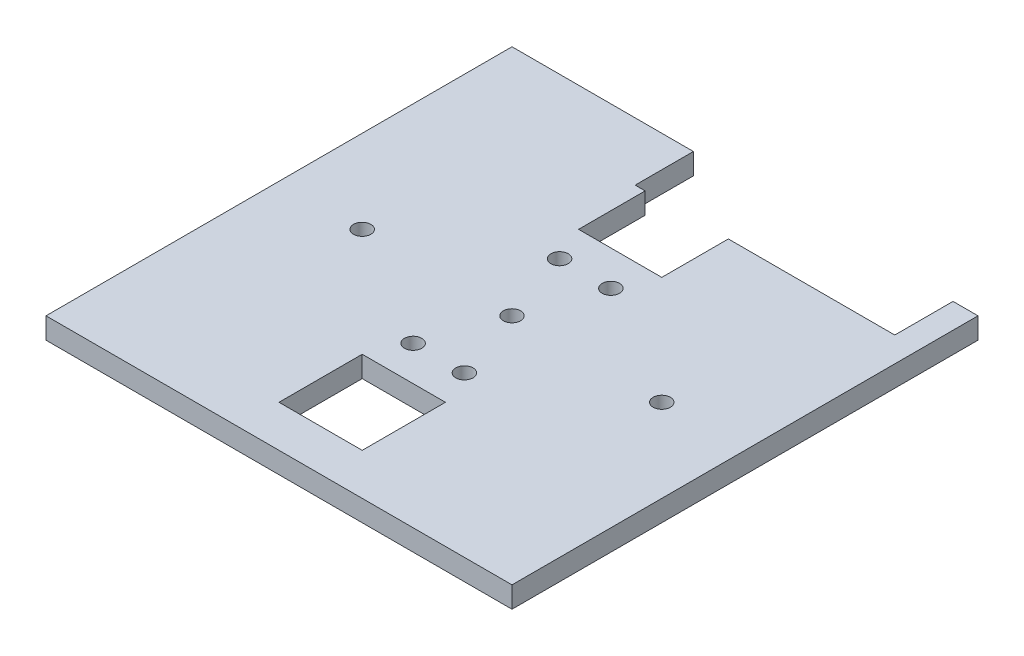
ISO-10303-21;
HEADER;
FILE_DESCRIPTION(('STEP AP214'),'2;1');
FILE_NAME('part.step','',(''),(''),'','','');
FILE_SCHEMA(('AUTOMOTIVE_DESIGN { 1 0 10303 214 1 1 1 1 }'));
ENDSEC;
DATA;
#1=APPLICATION_CONTEXT('core data for automotive mechanical design processes');
#2=APPLICATION_PROTOCOL_DEFINITION('international standard','automotive_design',2000,#1);
#3=PRODUCT_CONTEXT('',#1,'mechanical');
#4=PRODUCT('Part','Part','',(#3));
#5=PRODUCT_RELATED_PRODUCT_CATEGORY('part','',(#4));
#6=PRODUCT_DEFINITION_FORMATION('','',#4);
#7=PRODUCT_DEFINITION_CONTEXT('part definition',#1,'design');
#8=PRODUCT_DEFINITION('design','',#6,#7);
#9=PRODUCT_DEFINITION_SHAPE('','',#8);
#10=(LENGTH_UNIT() NAMED_UNIT(*) SI_UNIT(.MILLI.,.METRE.));
#11=(NAMED_UNIT(*) PLANE_ANGLE_UNIT() SI_UNIT($,.RADIAN.));
#12=(NAMED_UNIT(*) SI_UNIT($,.STERADIAN.) SOLID_ANGLE_UNIT());
#13=UNCERTAINTY_MEASURE_WITH_UNIT(LENGTH_MEASURE(1.E-05),#10,'distance_accuracy_value','');
#14=(GEOMETRIC_REPRESENTATION_CONTEXT(3) GLOBAL_UNCERTAINTY_ASSIGNED_CONTEXT((#13)) GLOBAL_UNIT_ASSIGNED_CONTEXT((#10,
#11,#12)) REPRESENTATION_CONTEXT('',''));
#15=CARTESIAN_POINT('',(0.,0.,0.));
#16=DIRECTION('',(0.,0.,1.));
#17=DIRECTION('',(1.,0.,0.));
#18=AXIS2_PLACEMENT_3D('',#15,#16,#17);
#19=CARTESIAN_POINT('',(0.,6.35,0.));
#20=DIRECTION('',(0.,-1.,0.));
#21=DIRECTION('',(0.,0.,-1.));
#22=AXIS2_PLACEMENT_3D('',#19,#20,#21);
#23=PLANE('',#22);
#24=CARTESIAN_POINT('',(104.8,6.35,-134.5));
#25=DIRECTION('',(0.,1.,0.));
#26=DIRECTION('',(0.,0.,1.));
#27=AXIS2_PLACEMENT_3D('',#24,#25,#26);
#28=CIRCLE('',#27,2.59999999999999);
#29=CARTESIAN_POINT('',(104.8,6.35,-131.9));
#30=VERTEX_POINT('',#29);
#31=EDGE_CURVE('E374',#30,#30,#28,.F.);
#32=ORIENTED_EDGE('',*,*,#31,.T.);
#33=EDGE_LOOP('',(#32));
#34=FACE_BOUND('',#33,.T.);
#35=DIRECTION('',(0.,0.,1.));
#36=VECTOR('',#35,1.);
#37=CARTESIAN_POINT('',(99.9999999999999,6.35,1.11022302462516E-13));
#38=LINE('',#37,#36);
#39=CARTESIAN_POINT('',(100.,6.35,-80.));
#40=VERTEX_POINT('',#39);
#41=CARTESIAN_POINT('',(100.,6.35,-55.));
#42=VERTEX_POINT('',#41);
#43=EDGE_CURVE('E304',#40,#42,#38,.T.);
#44=ORIENTED_EDGE('',*,*,#43,.F.);
#45=DIRECTION('',(-1.,0.,0.));
#46=VECTOR('',#45,1.);
#47=CARTESIAN_POINT('',(0.,6.35,-80.));
#48=LINE('',#47,#46);
#49=CARTESIAN_POINT('',(125.,6.35,-80.));
#50=VERTEX_POINT('',#49);
#51=EDGE_CURVE('E299',#50,#40,#48,.T.);
#52=ORIENTED_EDGE('',*,*,#51,.F.);
#53=DIRECTION('',(0.,0.,1.));
#54=VECTOR('',#53,1.);
#55=CARTESIAN_POINT('',(125.,6.35,-1.38777878078145E-13));
#56=LINE('',#55,#54);
#57=CARTESIAN_POINT('',(125.,6.35,-55.));
#58=VERTEX_POINT('',#57);
#59=EDGE_CURVE('E285',#50,#58,#56,.T.);
#60=ORIENTED_EDGE('',*,*,#59,.T.);
#61=DIRECTION('',(-1.,0.,0.));
#62=VECTOR('',#61,1.);
#63=CARTESIAN_POINT('',(0.,6.35,-55.));
#64=LINE('',#63,#62);
#65=EDGE_CURVE('E153',#58,#42,#64,.T.);
#66=ORIENTED_EDGE('',*,*,#65,.T.);
#67=EDGE_LOOP('',(#44,#52,#60,#66));
#68=FACE_BOUND('',#67,.T.);
#69=CARTESIAN_POINT('',(67.5,6.35,-112.5));
#70=DIRECTION('',(0.,1.,0.));
#71=DIRECTION('',(0.,0.,1.));
#72=AXIS2_PLACEMENT_3D('',#69,#70,#71);
#73=CIRCLE('',#72,2.6);
#74=CARTESIAN_POINT('',(67.5,6.35,-109.9));
#75=VERTEX_POINT('',#74);
#76=EDGE_CURVE('E363',#75,#75,#73,.T.);
#77=ORIENTED_EDGE('',*,*,#76,.F.);
#78=EDGE_LOOP('',(#77));
#79=FACE_BOUND('',#78,.T.);
#80=CARTESIAN_POINT('',(120.2,6.35,-134.5));
#81=DIRECTION('',(0.,1.,0.));
#82=DIRECTION('',(0.,0.,1.));
#83=AXIS2_PLACEMENT_3D('',#80,#81,#82);
#84=CIRCLE('',#83,2.59999999999999);
#85=CARTESIAN_POINT('',(120.2,6.35,-131.9));
#86=VERTEX_POINT('',#85);
#87=EDGE_CURVE('E378',#86,#86,#84,.T.);
#88=ORIENTED_EDGE('',*,*,#87,.F.);
#89=EDGE_LOOP('',(#88));
#90=FACE_BOUND('',#89,.T.);
#91=CARTESIAN_POINT('',(104.8,6.35,-90.5));
#92=DIRECTION('',(0.,1.,0.));
#93=DIRECTION('',(0.,0.,1.));
#94=AXIS2_PLACEMENT_3D('',#91,#92,#93);
#95=CIRCLE('',#94,2.59999999999999);
#96=CARTESIAN_POINT('',(104.8,6.35,-87.9));
#97=VERTEX_POINT('',#96);
#98=EDGE_CURVE('E362',#97,#97,#95,.F.);
#99=ORIENTED_EDGE('',*,*,#98,.T.);
#100=EDGE_LOOP('',(#99));
#101=FACE_BOUND('',#100,.T.);
#102=CARTESIAN_POINT('',(120.2,6.35,-90.5));
#103=DIRECTION('',(0.,1.,0.));
#104=DIRECTION('',(0.,0.,1.));
#105=AXIS2_PLACEMENT_3D('',#102,#103,#104);
#106=CIRCLE('',#105,2.59999999999999);
#107=CARTESIAN_POINT('',(120.2,6.35,-87.9));
#108=VERTEX_POINT('',#107);
#109=EDGE_CURVE('E388',#108,#108,#106,.T.);
#110=ORIENTED_EDGE('',*,*,#109,.F.);
#111=EDGE_LOOP('',(#110));
#112=FACE_BOUND('',#111,.T.);
#113=CARTESIAN_POINT('',(157.5,6.35,-112.5));
#114=DIRECTION('',(0.,1.,0.));
#115=DIRECTION('',(0.,0.,1.));
#116=AXIS2_PLACEMENT_3D('',#113,#114,#115);
#117=CIRCLE('',#116,2.59999999999999);
#118=CARTESIAN_POINT('',(157.5,6.35,-109.9));
#119=VERTEX_POINT('',#118);
#120=EDGE_CURVE('E382',#119,#119,#117,.T.);
#121=ORIENTED_EDGE('',*,*,#120,.F.);
#122=EDGE_LOOP('',(#121));
#123=FACE_BOUND('',#122,.T.);
#124=CARTESIAN_POINT('',(112.5,6.35,-112.5));
#125=DIRECTION('',(0.,1.,0.));
#126=DIRECTION('',(0.,0.,1.));
#127=AXIS2_PLACEMENT_3D('',#124,#125,#126);
#128=CIRCLE('',#127,2.6);
#129=CARTESIAN_POINT('',(112.5,6.35,-109.9));
#130=VERTEX_POINT('',#129);
#131=EDGE_CURVE('E375',#130,#130,#128,.T.);
#132=ORIENTED_EDGE('',*,*,#131,.F.);
#133=EDGE_LOOP('',(#132));
#134=FACE_BOUND('',#133,.T.);
#135=DIRECTION('',(-1.,0.,0.));
#136=VECTOR('',#135,1.);
#137=CARTESIAN_POINT('',(182.5,6.35,-182.5));
#138=LINE('',#137,#136);
#139=CARTESIAN_POINT('',(97.,6.35,-182.5));
#140=VERTEX_POINT('',#139);
#141=CARTESIAN_POINT('',(42.5,6.35,-182.5));
#142=VERTEX_POINT('',#141);
#143=EDGE_CURVE('E250',#140,#142,#138,.T.);
#144=ORIENTED_EDGE('',*,*,#143,.T.);
#145=DIRECTION('',(0.,0.,1.));
#146=VECTOR('',#145,1.);
#147=CARTESIAN_POINT('',(42.5000000000001,6.35,-42.5));
#148=LINE('',#147,#146);
#149=CARTESIAN_POINT('',(42.5000000000001,6.35,-42.5));
#150=VERTEX_POINT('',#149);
#151=EDGE_CURVE('E251',#142,#150,#148,.T.);
#152=ORIENTED_EDGE('',*,*,#151,.T.);
#153=DIRECTION('',(1.,0.,0.));
#154=VECTOR('',#153,1.);
#155=CARTESIAN_POINT('',(182.5,6.35,-42.5000000000001));
#156=LINE('',#155,#154);
#157=CARTESIAN_POINT('',(182.5,6.35,-42.5000000000001));
#158=VERTEX_POINT('',#157);
#159=EDGE_CURVE('E278',#150,#158,#156,.T.);
#160=ORIENTED_EDGE('',*,*,#159,.T.);
#161=DIRECTION('',(0.,0.,-1.));
#162=VECTOR('',#161,1.);
#163=CARTESIAN_POINT('',(182.5,6.35,-42.5000000000001));
#164=LINE('',#163,#162);
#165=CARTESIAN_POINT('',(182.5,6.35,-182.5));
#166=VERTEX_POINT('',#165);
#167=EDGE_CURVE('E275',#158,#166,#164,.T.);
#168=ORIENTED_EDGE('',*,*,#167,.T.);
#169=CARTESIAN_POINT('',(175.,6.35,-182.5));
#170=VERTEX_POINT('',#169);
#171=EDGE_CURVE('E246',#166,#170,#138,.T.);
#172=ORIENTED_EDGE('',*,*,#171,.T.);
#173=DIRECTION('',(0.,0.,1.));
#174=VECTOR('',#173,1.);
#175=CARTESIAN_POINT('',(175.,6.35,0.));
#176=LINE('',#175,#174);
#177=CARTESIAN_POINT('',(175.,6.35,-165.));
#178=VERTEX_POINT('',#177);
#179=EDGE_CURVE('E328',#170,#178,#176,.T.);
#180=ORIENTED_EDGE('',*,*,#179,.T.);
#181=DIRECTION('',(-1.,0.,0.));
#182=VECTOR('',#181,1.);
#183=CARTESIAN_POINT('',(0.,6.35,-165.));
#184=LINE('',#183,#182);
#185=CARTESIAN_POINT('',(125.,6.35,-165.));
#186=VERTEX_POINT('',#185);
#187=EDGE_CURVE('E317',#178,#186,#184,.T.);
#188=ORIENTED_EDGE('',*,*,#187,.T.);
#189=DIRECTION('',(0.,0.,-1.));
#190=VECTOR('',#189,1.);
#191=CARTESIAN_POINT('',(125.,6.35,0.));
#192=LINE('',#191,#190);
#193=CARTESIAN_POINT('',(125.,6.35,-145.));
#194=VERTEX_POINT('',#193);
#195=EDGE_CURVE('E349',#194,#186,#192,.T.);
#196=ORIENTED_EDGE('',*,*,#195,.F.);
#197=DIRECTION('',(-1.,0.,0.));
#198=VECTOR('',#197,1.);
#199=CARTESIAN_POINT('',(0.,6.35,-145.));
#200=LINE('',#199,#198);
#201=CARTESIAN_POINT('',(100.,6.35,-145.));
#202=VERTEX_POINT('',#201);
#203=EDGE_CURVE('E341',#194,#202,#200,.T.);
#204=ORIENTED_EDGE('',*,*,#203,.T.);
#205=DIRECTION('',(0.,0.,-1.));
#206=VECTOR('',#205,1.);
#207=CARTESIAN_POINT('',(100.,6.35,0.));
#208=LINE('',#207,#206);
#209=CARTESIAN_POINT('',(100.,6.35,-165.));
#210=VERTEX_POINT('',#209);
#211=EDGE_CURVE('E337',#202,#210,#208,.T.);
#212=ORIENTED_EDGE('',*,*,#211,.T.);
#213=CARTESIAN_POINT('',(97.,6.35,-165.));
#214=VERTEX_POINT('',#213);
#215=EDGE_CURVE('E322',#210,#214,#184,.T.);
#216=ORIENTED_EDGE('',*,*,#215,.T.);
#217=DIRECTION('',(0.,0.,1.));
#218=VECTOR('',#217,1.);
#219=CARTESIAN_POINT('',(97.0000000000001,6.35,0.));
#220=LINE('',#219,#218);
#221=EDGE_CURVE('E316',#140,#214,#220,.T.);
#222=ORIENTED_EDGE('',*,*,#221,.F.);
#223=EDGE_LOOP('',(#144,#152,#160,#168,#172,#180,#188,#196,#204,#212,#216,#222));
#224=FACE_BOUND('',#223,.T.);
#225=ADVANCED_FACE('F131',(#34,#68,#79,#90,#101,#112,#123,#134,#224),#23,.F.);
#226=CARTESIAN_POINT('',(0.,0.,0.));
#227=DIRECTION('',(0.,-1.,0.));
#228=DIRECTION('',(0.,0.,-1.));
#229=AXIS2_PLACEMENT_3D('',#226,#227,#228);
#230=PLANE('',#229);
#231=CARTESIAN_POINT('',(104.8,0.,-134.5));
#232=DIRECTION('',(0.,-1.,0.));
#233=DIRECTION('',(0.,0.,-1.));
#234=AXIS2_PLACEMENT_3D('',#231,#232,#233);
#235=CIRCLE('',#234,2.59999999999999);
#236=CARTESIAN_POINT('',(104.8,0.,-137.1));
#237=VERTEX_POINT('',#236);
#238=EDGE_CURVE('E371',#237,#237,#235,.T.);
#239=ORIENTED_EDGE('',*,*,#238,.F.);
#240=EDGE_LOOP('',(#239));
#241=FACE_BOUND('',#240,.T.);
#242=CARTESIAN_POINT('',(112.5,0.,-112.5));
#243=DIRECTION('',(0.,-1.,0.));
#244=DIRECTION('',(0.,0.,-1.));
#245=AXIS2_PLACEMENT_3D('',#242,#243,#244);
#246=CIRCLE('',#245,2.6);
#247=CARTESIAN_POINT('',(112.5,0.,-115.1));
#248=VERTEX_POINT('',#247);
#249=EDGE_CURVE('E379',#248,#248,#246,.F.);
#250=ORIENTED_EDGE('',*,*,#249,.T.);
#251=EDGE_LOOP('',(#250));
#252=FACE_BOUND('',#251,.T.);
#253=CARTESIAN_POINT('',(157.5,0.,-112.5));
#254=DIRECTION('',(0.,-1.,0.));
#255=DIRECTION('',(0.,0.,-1.));
#256=AXIS2_PLACEMENT_3D('',#253,#254,#255);
#257=CIRCLE('',#256,2.59999999999999);
#258=CARTESIAN_POINT('',(157.5,0.,-115.1));
#259=VERTEX_POINT('',#258);
#260=EDGE_CURVE('E385',#259,#259,#257,.F.);
#261=ORIENTED_EDGE('',*,*,#260,.T.);
#262=EDGE_LOOP('',(#261));
#263=FACE_BOUND('',#262,.T.);
#264=CARTESIAN_POINT('',(120.2,0.,-90.5));
#265=DIRECTION('',(0.,-1.,0.));
#266=DIRECTION('',(0.,0.,-1.));
#267=AXIS2_PLACEMENT_3D('',#264,#265,#266);
#268=CIRCLE('',#267,2.59999999999999);
#269=CARTESIAN_POINT('',(120.2,0.,-93.1));
#270=VERTEX_POINT('',#269);
#271=EDGE_CURVE('E366',#270,#270,#268,.F.);
#272=ORIENTED_EDGE('',*,*,#271,.T.);
#273=EDGE_LOOP('',(#272));
#274=FACE_BOUND('',#273,.T.);
#275=DIRECTION('',(-1.,0.,0.));
#276=VECTOR('',#275,1.);
#277=CARTESIAN_POINT('',(0.,0.,-80.));
#278=LINE('',#277,#276);
#279=CARTESIAN_POINT('',(125.,0.,-80.));
#280=VERTEX_POINT('',#279);
#281=CARTESIAN_POINT('',(100.,0.,-80.));
#282=VERTEX_POINT('',#281);
#283=EDGE_CURVE('E288',#280,#282,#278,.T.);
#284=ORIENTED_EDGE('',*,*,#283,.T.);
#285=DIRECTION('',(0.,0.,1.));
#286=VECTOR('',#285,1.);
#287=CARTESIAN_POINT('',(99.9999999999999,0.,1.11022302462516E-13));
#288=LINE('',#287,#286);
#289=CARTESIAN_POINT('',(100.,0.,-55.));
#290=VERTEX_POINT('',#289);
#291=EDGE_CURVE('E289',#282,#290,#288,.T.);
#292=ORIENTED_EDGE('',*,*,#291,.T.);
#293=DIRECTION('',(-1.,0.,0.));
#294=VECTOR('',#293,1.);
#295=CARTESIAN_POINT('',(0.,0.,-55.));
#296=LINE('',#295,#294);
#297=CARTESIAN_POINT('',(125.,0.,-55.));
#298=VERTEX_POINT('',#297);
#299=EDGE_CURVE('E296',#298,#290,#296,.T.);
#300=ORIENTED_EDGE('',*,*,#299,.F.);
#301=DIRECTION('',(0.,0.,1.));
#302=VECTOR('',#301,1.);
#303=CARTESIAN_POINT('',(125.,0.,-1.38777878078145E-13));
#304=LINE('',#303,#302);
#305=EDGE_CURVE('E298',#280,#298,#304,.T.);
#306=ORIENTED_EDGE('',*,*,#305,.F.);
#307=EDGE_LOOP('',(#284,#292,#300,#306));
#308=FACE_BOUND('',#307,.T.);
#309=CARTESIAN_POINT('',(67.5,0.,-112.5));
#310=DIRECTION('',(0.,-1.,0.));
#311=DIRECTION('',(0.,0.,-1.));
#312=AXIS2_PLACEMENT_3D('',#309,#310,#311);
#313=CIRCLE('',#312,2.6);
#314=CARTESIAN_POINT('',(67.5,0.,-115.1));
#315=VERTEX_POINT('',#314);
#316=EDGE_CURVE('E301',#315,#315,#313,.F.);
#317=ORIENTED_EDGE('',*,*,#316,.T.);
#318=EDGE_LOOP('',(#317));
#319=FACE_BOUND('',#318,.T.);
#320=CARTESIAN_POINT('',(120.2,0.,-134.5));
#321=DIRECTION('',(0.,-1.,0.));
#322=DIRECTION('',(0.,0.,-1.));
#323=AXIS2_PLACEMENT_3D('',#320,#321,#322);
#324=CIRCLE('',#323,2.59999999999999);
#325=CARTESIAN_POINT('',(120.2,0.,-137.1));
#326=VERTEX_POINT('',#325);
#327=EDGE_CURVE('E139',#326,#326,#324,.F.);
#328=ORIENTED_EDGE('',*,*,#327,.T.);
#329=EDGE_LOOP('',(#328));
#330=FACE_BOUND('',#329,.T.);
#331=CARTESIAN_POINT('',(104.8,0.,-90.5));
#332=DIRECTION('',(0.,-1.,0.));
#333=DIRECTION('',(0.,0.,-1.));
#334=AXIS2_PLACEMENT_3D('',#331,#332,#333);
#335=CIRCLE('',#334,2.59999999999999);
#336=CARTESIAN_POINT('',(104.8,0.,-93.1));
#337=VERTEX_POINT('',#336);
#338=EDGE_CURVE('E359',#337,#337,#335,.T.);
#339=ORIENTED_EDGE('',*,*,#338,.F.);
#340=EDGE_LOOP('',(#339));
#341=FACE_BOUND('',#340,.T.);
#342=DIRECTION('',(0.,0.,1.));
#343=VECTOR('',#342,1.);
#344=CARTESIAN_POINT('',(42.5000000000001,0.,-42.5));
#345=LINE('',#344,#343);
#346=CARTESIAN_POINT('',(42.5,0.,-182.5));
#347=VERTEX_POINT('',#346);
#348=CARTESIAN_POINT('',(42.5000000000001,0.,-42.5));
#349=VERTEX_POINT('',#348);
#350=EDGE_CURVE('E267',#347,#349,#345,.T.);
#351=ORIENTED_EDGE('',*,*,#350,.F.);
#352=DIRECTION('',(-1.,0.,0.));
#353=VECTOR('',#352,1.);
#354=CARTESIAN_POINT('',(182.5,0.,-182.5));
#355=LINE('',#354,#353);
#356=CARTESIAN_POINT('',(97.,0.,-182.5));
#357=VERTEX_POINT('',#356);
#358=EDGE_CURVE('E260',#357,#347,#355,.T.);
#359=ORIENTED_EDGE('',*,*,#358,.F.);
#360=DIRECTION('',(0.,0.,1.));
#361=VECTOR('',#360,1.);
#362=CARTESIAN_POINT('',(97.0000000000001,0.,0.));
#363=LINE('',#362,#361);
#364=CARTESIAN_POINT('',(97.,0.,-165.));
#365=VERTEX_POINT('',#364);
#366=EDGE_CURVE('E321',#357,#365,#363,.T.);
#367=ORIENTED_EDGE('',*,*,#366,.T.);
#368=DIRECTION('',(-1.,0.,0.));
#369=VECTOR('',#368,1.);
#370=CARTESIAN_POINT('',(0.,0.,-165.));
#371=LINE('',#370,#369);
#372=CARTESIAN_POINT('',(100.,0.,-165.));
#373=VERTEX_POINT('',#372);
#374=EDGE_CURVE('E307',#373,#365,#371,.T.);
#375=ORIENTED_EDGE('',*,*,#374,.F.);
#376=DIRECTION('',(0.,0.,-1.));
#377=VECTOR('',#376,1.);
#378=CARTESIAN_POINT('',(100.,0.,0.));
#379=LINE('',#378,#377);
#380=CARTESIAN_POINT('',(100.,0.,-145.));
#381=VERTEX_POINT('',#380);
#382=EDGE_CURVE('E282',#381,#373,#379,.T.);
#383=ORIENTED_EDGE('',*,*,#382,.F.);
#384=DIRECTION('',(-1.,0.,0.));
#385=VECTOR('',#384,1.);
#386=CARTESIAN_POINT('',(0.,0.,-145.));
#387=LINE('',#386,#385);
#388=CARTESIAN_POINT('',(125.,0.,-145.));
#389=VERTEX_POINT('',#388);
#390=EDGE_CURVE('E346',#389,#381,#387,.T.);
#391=ORIENTED_EDGE('',*,*,#390,.F.);
#392=DIRECTION('',(0.,0.,-1.));
#393=VECTOR('',#392,1.);
#394=CARTESIAN_POINT('',(125.,0.,0.));
#395=LINE('',#394,#393);
#396=CARTESIAN_POINT('',(125.,0.,-165.));
#397=VERTEX_POINT('',#396);
#398=EDGE_CURVE('E343',#389,#397,#395,.T.);
#399=ORIENTED_EDGE('',*,*,#398,.T.);
#400=DIRECTION('',(-1.,0.,0.));
#401=VECTOR('',#400,1.);
#402=CARTESIAN_POINT('',(0.,0.,-165.));
#403=LINE('',#402,#401);
#404=CARTESIAN_POINT('',(175.,0.,-165.));
#405=VERTEX_POINT('',#404);
#406=EDGE_CURVE('E323',#405,#397,#403,.T.);
#407=ORIENTED_EDGE('',*,*,#406,.F.);
#408=DIRECTION('',(0.,0.,1.));
#409=VECTOR('',#408,1.);
#410=CARTESIAN_POINT('',(175.,0.,0.));
#411=LINE('',#410,#409);
#412=CARTESIAN_POINT('',(175.,0.,-182.5));
#413=VERTEX_POINT('',#412);
#414=EDGE_CURVE('E266',#413,#405,#411,.T.);
#415=ORIENTED_EDGE('',*,*,#414,.F.);
#416=CARTESIAN_POINT('',(182.5,0.,-182.5));
#417=VERTEX_POINT('',#416);
#418=EDGE_CURVE('E146',#417,#413,#355,.T.);
#419=ORIENTED_EDGE('',*,*,#418,.F.);
#420=DIRECTION('',(0.,0.,-1.));
#421=VECTOR('',#420,1.);
#422=CARTESIAN_POINT('',(182.5,0.,-42.5000000000001));
#423=LINE('',#422,#421);
#424=CARTESIAN_POINT('',(182.5,0.,-42.5000000000001));
#425=VERTEX_POINT('',#424);
#426=EDGE_CURVE('E254',#425,#417,#423,.T.);
#427=ORIENTED_EDGE('',*,*,#426,.F.);
#428=DIRECTION('',(1.,0.,0.));
#429=VECTOR('',#428,1.);
#430=CARTESIAN_POINT('',(182.5,0.,-42.5000000000001));
#431=LINE('',#430,#429);
#432=EDGE_CURVE('E261',#349,#425,#431,.T.);
#433=ORIENTED_EDGE('',*,*,#432,.F.);
#434=EDGE_LOOP('',(#351,#359,#367,#375,#383,#391,#399,#407,#415,#419,#427,#433));
#435=FACE_BOUND('',#434,.T.);
#436=ADVANCED_FACE('F133',(#241,#252,#263,#274,#308,#319,#330,#341,#435),#230,.T.);
#437=CARTESIAN_POINT('',(97.0000000000001,-98.4073168011403,0.));
#438=DIRECTION('',(-1.,0.,0.));
#439=DIRECTION('',(0.,0.,1.));
#440=AXIS2_PLACEMENT_3D('',#437,#438,#439);
#441=PLANE('',#440);
#442=DIRECTION('',(0.,-1.,0.));
#443=VECTOR('',#442,1.);
#444=CARTESIAN_POINT('',(97.,-98.4073168011403,-182.5));
#445=LINE('',#444,#443);
#446=EDGE_CURVE('E270',#140,#357,#445,.T.);
#447=ORIENTED_EDGE('',*,*,#446,.F.);
#448=ORIENTED_EDGE('',*,*,#221,.T.);
#449=DIRECTION('',(0.,1.,0.));
#450=VECTOR('',#449,1.);
#451=CARTESIAN_POINT('',(97.,-98.4073168011403,-165.));
#452=LINE('',#451,#450);
#453=EDGE_CURVE('E318',#365,#214,#452,.T.);
#454=ORIENTED_EDGE('',*,*,#453,.F.);
#455=ORIENTED_EDGE('',*,*,#366,.F.);
#456=EDGE_LOOP('',(#447,#448,#454,#455));
#457=FACE_BOUND('',#456,.T.);
#458=ADVANCED_FACE('F414',(#457),#441,.F.);
#459=CARTESIAN_POINT('',(175.,-98.4073168011403,0.));
#460=DIRECTION('',(-1.,0.,0.));
#461=DIRECTION('',(0.,0.,1.));
#462=AXIS2_PLACEMENT_3D('',#459,#460,#461);
#463=PLANE('',#462);
#464=ORIENTED_EDGE('',*,*,#179,.F.);
#465=DIRECTION('',(0.,-1.,0.));
#466=VECTOR('',#465,1.);
#467=CARTESIAN_POINT('',(175.,-98.4073168011403,-182.5));
#468=LINE('',#467,#466);
#469=EDGE_CURVE('E12',#170,#413,#468,.T.);
#470=ORIENTED_EDGE('',*,*,#469,.T.);
#471=ORIENTED_EDGE('',*,*,#414,.T.);
#472=DIRECTION('',(0.,1.,0.));
#473=VECTOR('',#472,1.);
#474=CARTESIAN_POINT('',(175.,-98.4073168011403,-165.));
#475=LINE('',#474,#473);
#476=EDGE_CURVE('E313',#405,#178,#475,.T.);
#477=ORIENTED_EDGE('',*,*,#476,.T.);
#478=EDGE_LOOP('',(#464,#470,#471,#477));
#479=FACE_BOUND('',#478,.T.);
#480=ADVANCED_FACE('F404',(#479),#463,.T.);
#481=CARTESIAN_POINT('',(120.2,-98.4073168011403,-134.5));
#482=DIRECTION('',(0.,1.,0.));
#483=DIRECTION('',(0.,0.,1.));
#484=AXIS2_PLACEMENT_3D('',#481,#482,#483);
#485=CYLINDRICAL_SURFACE('',#484,2.59999999999999);
#486=ORIENTED_EDGE('',*,*,#87,.T.);
#487=EDGE_LOOP('',(#486));
#488=FACE_BOUND('',#487,.T.);
#489=ORIENTED_EDGE('',*,*,#327,.F.);
#490=EDGE_LOOP('',(#489));
#491=FACE_BOUND('',#490,.T.);
#492=ADVANCED_FACE('F401',(#488,#491),#485,.F.);
#493=CARTESIAN_POINT('',(104.8,-98.4073168011403,-90.5));
#494=DIRECTION('',(0.,1.,0.));
#495=DIRECTION('',(0.,0.,1.));
#496=AXIS2_PLACEMENT_3D('',#493,#494,#495);
#497=CYLINDRICAL_SURFACE('',#496,2.59999999999999);
#498=ORIENTED_EDGE('',*,*,#98,.F.);
#499=EDGE_LOOP('',(#498));
#500=FACE_BOUND('',#499,.T.);
#501=ORIENTED_EDGE('',*,*,#338,.T.);
#502=EDGE_LOOP('',(#501));
#503=FACE_BOUND('',#502,.T.);
#504=ADVANCED_FACE('F403',(#500,#503),#497,.F.);
#505=CARTESIAN_POINT('',(67.5,-98.4073168011403,-112.5));
#506=DIRECTION('',(0.,1.,0.));
#507=DIRECTION('',(0.,0.,1.));
#508=AXIS2_PLACEMENT_3D('',#505,#506,#507);
#509=CYLINDRICAL_SURFACE('',#508,2.6);
#510=ORIENTED_EDGE('',*,*,#76,.T.);
#511=EDGE_LOOP('',(#510));
#512=FACE_BOUND('',#511,.T.);
#513=ORIENTED_EDGE('',*,*,#316,.F.);
#514=EDGE_LOOP('',(#513));
#515=FACE_BOUND('',#514,.T.);
#516=ADVANCED_FACE('F411',(#512,#515),#509,.F.);
#517=CARTESIAN_POINT('',(0.,-98.4073168011403,-80.));
#518=DIRECTION('',(0.,0.,-1.));
#519=DIRECTION('',(-1.,0.,0.));
#520=AXIS2_PLACEMENT_3D('',#517,#518,#519);
#521=PLANE('',#520);
#522=DIRECTION('',(0.,1.,0.));
#523=VECTOR('',#522,1.);
#524=CARTESIAN_POINT('',(125.,-98.4073168011403,-80.));
#525=LINE('',#524,#523);
#526=EDGE_CURVE('E283',#280,#50,#525,.T.);
#527=ORIENTED_EDGE('',*,*,#526,.T.);
#528=ORIENTED_EDGE('',*,*,#51,.T.);
#529=DIRECTION('',(0.,1.,0.));
#530=VECTOR('',#529,1.);
#531=CARTESIAN_POINT('',(100.,-98.4073168011403,-80.));
#532=LINE('',#531,#530);
#533=EDGE_CURVE('E286',#282,#40,#532,.T.);
#534=ORIENTED_EDGE('',*,*,#533,.F.);
#535=ORIENTED_EDGE('',*,*,#283,.F.);
#536=EDGE_LOOP('',(#527,#528,#534,#535));
#537=FACE_BOUND('',#536,.T.);
#538=ADVANCED_FACE('F505',(#537),#521,.F.);
#539=CARTESIAN_POINT('',(99.9999999999999,-98.4073168011403,1.11022302462516E-13));
#540=DIRECTION('',(-1.,0.,0.));
#541=DIRECTION('',(0.,0.,1.));
#542=AXIS2_PLACEMENT_3D('',#539,#540,#541);
#543=PLANE('',#542);
#544=ORIENTED_EDGE('',*,*,#533,.T.);
#545=ORIENTED_EDGE('',*,*,#43,.T.);
#546=DIRECTION('',(0.,1.,0.));
#547=VECTOR('',#546,1.);
#548=CARTESIAN_POINT('',(100.,-98.4073168011403,-55.));
#549=LINE('',#548,#547);
#550=EDGE_CURVE('E290',#290,#42,#549,.T.);
#551=ORIENTED_EDGE('',*,*,#550,.F.);
#552=ORIENTED_EDGE('',*,*,#291,.F.);
#553=EDGE_LOOP('',(#544,#545,#551,#552));
#554=FACE_BOUND('',#553,.T.);
#555=ADVANCED_FACE('F536',(#554),#543,.F.);
#556=CARTESIAN_POINT('',(0.,-98.4073168011403,-55.));
#557=DIRECTION('',(0.,0.,-1.));
#558=DIRECTION('',(-1.,0.,0.));
#559=AXIS2_PLACEMENT_3D('',#556,#557,#558);
#560=PLANE('',#559);
#561=ORIENTED_EDGE('',*,*,#299,.T.);
#562=ORIENTED_EDGE('',*,*,#550,.T.);
#563=ORIENTED_EDGE('',*,*,#65,.F.);
#564=DIRECTION('',(0.,1.,0.));
#565=VECTOR('',#564,1.);
#566=CARTESIAN_POINT('',(125.,-98.4073168011403,-55.));
#567=LINE('',#566,#565);
#568=EDGE_CURVE('E292',#298,#58,#567,.T.);
#569=ORIENTED_EDGE('',*,*,#568,.F.);
#570=EDGE_LOOP('',(#561,#562,#563,#569));
#571=FACE_BOUND('',#570,.T.);
#572=ADVANCED_FACE('F538',(#571),#560,.T.);
#573=CARTESIAN_POINT('',(125.,-98.4073168011403,-1.38777878078145E-13));
#574=DIRECTION('',(-1.,0.,0.));
#575=DIRECTION('',(0.,0.,1.));
#576=AXIS2_PLACEMENT_3D('',#573,#574,#575);
#577=PLANE('',#576);
#578=ORIENTED_EDGE('',*,*,#305,.T.);
#579=ORIENTED_EDGE('',*,*,#568,.T.);
#580=ORIENTED_EDGE('',*,*,#59,.F.);
#581=ORIENTED_EDGE('',*,*,#526,.F.);
#582=EDGE_LOOP('',(#578,#579,#580,#581));
#583=FACE_BOUND('',#582,.T.);
#584=ADVANCED_FACE('F500',(#583),#577,.T.);
#585=CARTESIAN_POINT('',(125.,-98.4073168011403,0.));
#586=DIRECTION('',(1.,0.,0.));
#587=DIRECTION('',(0.,0.,-1.));
#588=AXIS2_PLACEMENT_3D('',#585,#586,#587);
#589=PLANE('',#588);
#590=DIRECTION('',(0.,1.,0.));
#591=VECTOR('',#590,1.);
#592=CARTESIAN_POINT('',(125.,-98.4073168011403,-145.));
#593=LINE('',#592,#591);
#594=EDGE_CURVE('E338',#389,#194,#593,.T.);
#595=ORIENTED_EDGE('',*,*,#594,.T.);
#596=ORIENTED_EDGE('',*,*,#195,.T.);
#597=DIRECTION('',(0.,1.,0.));
#598=VECTOR('',#597,1.);
#599=CARTESIAN_POINT('',(125.,-98.4073168011403,-165.));
#600=LINE('',#599,#598);
#601=EDGE_CURVE('E340',#397,#186,#600,.T.);
#602=ORIENTED_EDGE('',*,*,#601,.F.);
#603=ORIENTED_EDGE('',*,*,#398,.F.);
#604=EDGE_LOOP('',(#595,#596,#602,#603));
#605=FACE_BOUND('',#604,.T.);
#606=ADVANCED_FACE('F479',(#605),#589,.F.);
#607=CARTESIAN_POINT('',(100.,-98.4073168011403,0.));
#608=DIRECTION('',(1.,0.,0.));
#609=DIRECTION('',(0.,0.,-1.));
#610=AXIS2_PLACEMENT_3D('',#607,#608,#609);
#611=PLANE('',#610);
#612=ORIENTED_EDGE('',*,*,#382,.T.);
#613=DIRECTION('',(0.,1.,0.));
#614=VECTOR('',#613,1.);
#615=CARTESIAN_POINT('',(100.,-98.4073168011403,-165.));
#616=LINE('',#615,#614);
#617=EDGE_CURVE('E344',#373,#210,#616,.T.);
#618=ORIENTED_EDGE('',*,*,#617,.T.);
#619=ORIENTED_EDGE('',*,*,#211,.F.);
#620=DIRECTION('',(0.,1.,0.));
#621=VECTOR('',#620,1.);
#622=CARTESIAN_POINT('',(100.,-98.4073168011403,-145.));
#623=LINE('',#622,#621);
#624=EDGE_CURVE('E333',#381,#202,#623,.T.);
#625=ORIENTED_EDGE('',*,*,#624,.F.);
#626=EDGE_LOOP('',(#612,#618,#619,#625));
#627=FACE_BOUND('',#626,.T.);
#628=ADVANCED_FACE('F471',(#627),#611,.T.);
#629=CARTESIAN_POINT('',(0.,-98.4073168011403,-145.));
#630=DIRECTION('',(0.,0.,-1.));
#631=DIRECTION('',(-1.,0.,0.));
#632=AXIS2_PLACEMENT_3D('',#629,#630,#631);
#633=PLANE('',#632);
#634=ORIENTED_EDGE('',*,*,#390,.T.);
#635=ORIENTED_EDGE('',*,*,#624,.T.);
#636=ORIENTED_EDGE('',*,*,#203,.F.);
#637=ORIENTED_EDGE('',*,*,#594,.F.);
#638=EDGE_LOOP('',(#634,#635,#636,#637));
#639=FACE_BOUND('',#638,.T.);
#640=ADVANCED_FACE('F475',(#639),#633,.T.);
#641=CARTESIAN_POINT('',(0.,-98.4073168011403,-165.));
#642=DIRECTION('',(0.,0.,-1.));
#643=DIRECTION('',(-1.,0.,0.));
#644=AXIS2_PLACEMENT_3D('',#641,#642,#643);
#645=PLANE('',#644);
#646=ORIENTED_EDGE('',*,*,#406,.T.);
#647=ORIENTED_EDGE('',*,*,#601,.T.);
#648=ORIENTED_EDGE('',*,*,#187,.F.);
#649=ORIENTED_EDGE('',*,*,#476,.F.);
#650=EDGE_LOOP('',(#646,#647,#648,#649));
#651=FACE_BOUND('',#650,.T.);
#652=ADVANCED_FACE('F484',(#651),#645,.T.);
#653=ORIENTED_EDGE('',*,*,#374,.T.);
#654=ORIENTED_EDGE('',*,*,#453,.T.);
#655=ORIENTED_EDGE('',*,*,#215,.F.);
#656=ORIENTED_EDGE('',*,*,#617,.F.);
#657=EDGE_LOOP('',(#653,#654,#655,#656));
#658=FACE_BOUND('',#657,.T.);
#659=ADVANCED_FACE('F467',(#658),#645,.T.);
#660=CARTESIAN_POINT('',(120.2,-98.4073168011403,-90.5));
#661=DIRECTION('',(0.,1.,0.));
#662=DIRECTION('',(0.,0.,1.));
#663=AXIS2_PLACEMENT_3D('',#660,#661,#662);
#664=CYLINDRICAL_SURFACE('',#663,2.59999999999999);
#665=ORIENTED_EDGE('',*,*,#109,.T.);
#666=EDGE_LOOP('',(#665));
#667=FACE_BOUND('',#666,.T.);
#668=ORIENTED_EDGE('',*,*,#271,.F.);
#669=EDGE_LOOP('',(#668));
#670=FACE_BOUND('',#669,.T.);
#671=ADVANCED_FACE('F492',(#667,#670),#664,.F.);
#672=CARTESIAN_POINT('',(157.5,-98.4073168011403,-112.5));
#673=DIRECTION('',(0.,1.,0.));
#674=DIRECTION('',(0.,0.,1.));
#675=AXIS2_PLACEMENT_3D('',#672,#673,#674);
#676=CYLINDRICAL_SURFACE('',#675,2.59999999999999);
#677=ORIENTED_EDGE('',*,*,#120,.T.);
#678=EDGE_LOOP('',(#677));
#679=FACE_BOUND('',#678,.T.);
#680=ORIENTED_EDGE('',*,*,#260,.F.);
#681=EDGE_LOOP('',(#680));
#682=FACE_BOUND('',#681,.T.);
#683=ADVANCED_FACE('F514',(#679,#682),#676,.F.);
#684=CARTESIAN_POINT('',(112.5,-98.4073168011403,-112.5));
#685=DIRECTION('',(0.,1.,0.));
#686=DIRECTION('',(0.,0.,1.));
#687=AXIS2_PLACEMENT_3D('',#684,#685,#686);
#688=CYLINDRICAL_SURFACE('',#687,2.6);
#689=ORIENTED_EDGE('',*,*,#131,.T.);
#690=EDGE_LOOP('',(#689));
#691=FACE_BOUND('',#690,.T.);
#692=ORIENTED_EDGE('',*,*,#249,.F.);
#693=EDGE_LOOP('',(#692));
#694=FACE_BOUND('',#693,.T.);
#695=ADVANCED_FACE('F510',(#691,#694),#688,.F.);
#696=CARTESIAN_POINT('',(104.8,-98.4073168011403,-134.5));
#697=DIRECTION('',(0.,1.,0.));
#698=DIRECTION('',(0.,0.,1.));
#699=AXIS2_PLACEMENT_3D('',#696,#697,#698);
#700=CYLINDRICAL_SURFACE('',#699,2.59999999999999);
#701=ORIENTED_EDGE('',*,*,#31,.F.);
#702=EDGE_LOOP('',(#701));
#703=FACE_BOUND('',#702,.T.);
#704=ORIENTED_EDGE('',*,*,#238,.T.);
#705=EDGE_LOOP('',(#704));
#706=FACE_BOUND('',#705,.T.);
#707=ADVANCED_FACE('F507',(#703,#706),#700,.F.);
#708=CARTESIAN_POINT('',(182.5,-318.198051533946,-182.5));
#709=DIRECTION('',(0.,0.,-1.));
#710=DIRECTION('',(-1.,0.,0.));
#711=AXIS2_PLACEMENT_3D('',#708,#709,#710);
#712=PLANE('',#711);
#713=ORIENTED_EDGE('',*,*,#446,.T.);
#714=ORIENTED_EDGE('',*,*,#358,.T.);
#715=DIRECTION('',(0.,1.,0.));
#716=VECTOR('',#715,1.);
#717=CARTESIAN_POINT('',(42.5,-318.198051533946,-182.5));
#718=LINE('',#717,#716);
#719=EDGE_CURVE('E279',#347,#142,#718,.T.);
#720=ORIENTED_EDGE('',*,*,#719,.T.);
#721=ORIENTED_EDGE('',*,*,#143,.F.);
#722=EDGE_LOOP('',(#713,#714,#720,#721));
#723=FACE_BOUND('',#722,.T.);
#724=ADVANCED_FACE('F460',(#723),#712,.T.);
#725=CARTESIAN_POINT('',(182.5,-318.198051533946,-42.5000000000001));
#726=DIRECTION('',(1.,0.,0.));
#727=DIRECTION('',(0.,0.,-1.));
#728=AXIS2_PLACEMENT_3D('',#725,#726,#727);
#729=PLANE('',#728);
#730=ORIENTED_EDGE('',*,*,#426,.T.);
#731=DIRECTION('',(0.,1.,0.));
#732=VECTOR('',#731,1.);
#733=CARTESIAN_POINT('',(182.5,-318.198051533946,-182.5));
#734=LINE('',#733,#732);
#735=EDGE_CURVE('E242',#417,#166,#734,.T.);
#736=ORIENTED_EDGE('',*,*,#735,.T.);
#737=ORIENTED_EDGE('',*,*,#167,.F.);
#738=DIRECTION('',(0.,1.,0.));
#739=VECTOR('',#738,1.);
#740=CARTESIAN_POINT('',(182.5,-318.198051533946,-42.5000000000001));
#741=LINE('',#740,#739);
#742=EDGE_CURVE('E256',#425,#158,#741,.T.);
#743=ORIENTED_EDGE('',*,*,#742,.F.);
#744=EDGE_LOOP('',(#730,#736,#737,#743));
#745=FACE_BOUND('',#744,.T.);
#746=ADVANCED_FACE('F255',(#745),#729,.T.);
#747=CARTESIAN_POINT('',(182.5,-318.198051533946,-42.5000000000001));
#748=DIRECTION('',(0.,0.,1.));
#749=DIRECTION('',(1.,0.,0.));
#750=AXIS2_PLACEMENT_3D('',#747,#748,#749);
#751=PLANE('',#750);
#752=ORIENTED_EDGE('',*,*,#432,.T.);
#753=ORIENTED_EDGE('',*,*,#742,.T.);
#754=ORIENTED_EDGE('',*,*,#159,.F.);
#755=DIRECTION('',(0.,1.,0.));
#756=VECTOR('',#755,1.);
#757=CARTESIAN_POINT('',(42.5000000000001,-318.198051533946,-42.5));
#758=LINE('',#757,#756);
#759=EDGE_CURVE('E276',#349,#150,#758,.T.);
#760=ORIENTED_EDGE('',*,*,#759,.F.);
#761=EDGE_LOOP('',(#752,#753,#754,#760));
#762=FACE_BOUND('',#761,.T.);
#763=ADVANCED_FACE('F453',(#762),#751,.T.);
#764=CARTESIAN_POINT('',(42.5000000000001,-318.198051533946,-42.5));
#765=DIRECTION('',(-1.,0.,0.));
#766=DIRECTION('',(0.,0.,1.));
#767=AXIS2_PLACEMENT_3D('',#764,#765,#766);
#768=PLANE('',#767);
#769=ORIENTED_EDGE('',*,*,#350,.T.);
#770=ORIENTED_EDGE('',*,*,#759,.T.);
#771=ORIENTED_EDGE('',*,*,#151,.F.);
#772=ORIENTED_EDGE('',*,*,#719,.F.);
#773=EDGE_LOOP('',(#769,#770,#771,#772));
#774=FACE_BOUND('',#773,.T.);
#775=ADVANCED_FACE('F459',(#774),#768,.T.);
#776=ORIENTED_EDGE('',*,*,#171,.F.);
#777=ORIENTED_EDGE('',*,*,#735,.F.);
#778=ORIENTED_EDGE('',*,*,#418,.T.);
#779=ORIENTED_EDGE('',*,*,#469,.F.);
#780=EDGE_LOOP('',(#776,#777,#778,#779));
#781=FACE_BOUND('',#780,.T.);
#782=ADVANCED_FACE('F244',(#781),#712,.T.);
#783=CLOSED_SHELL('',(#225,#436,#458,#480,#492,#504,#516,#538,#555,#572,#584,#606,#628,#640,
#652,#659,#671,#683,#695,#707,#724,#746,#763,#775,#782));
#784=MANIFOLD_SOLID_BREP('B2',#783);
#785=ADVANCED_BREP_SHAPE_REPRESENTATION('',(#18,#784),#14);
#786=SHAPE_DEFINITION_REPRESENTATION(#9,#785);
ENDSEC;
END-ISO-10303-21;
